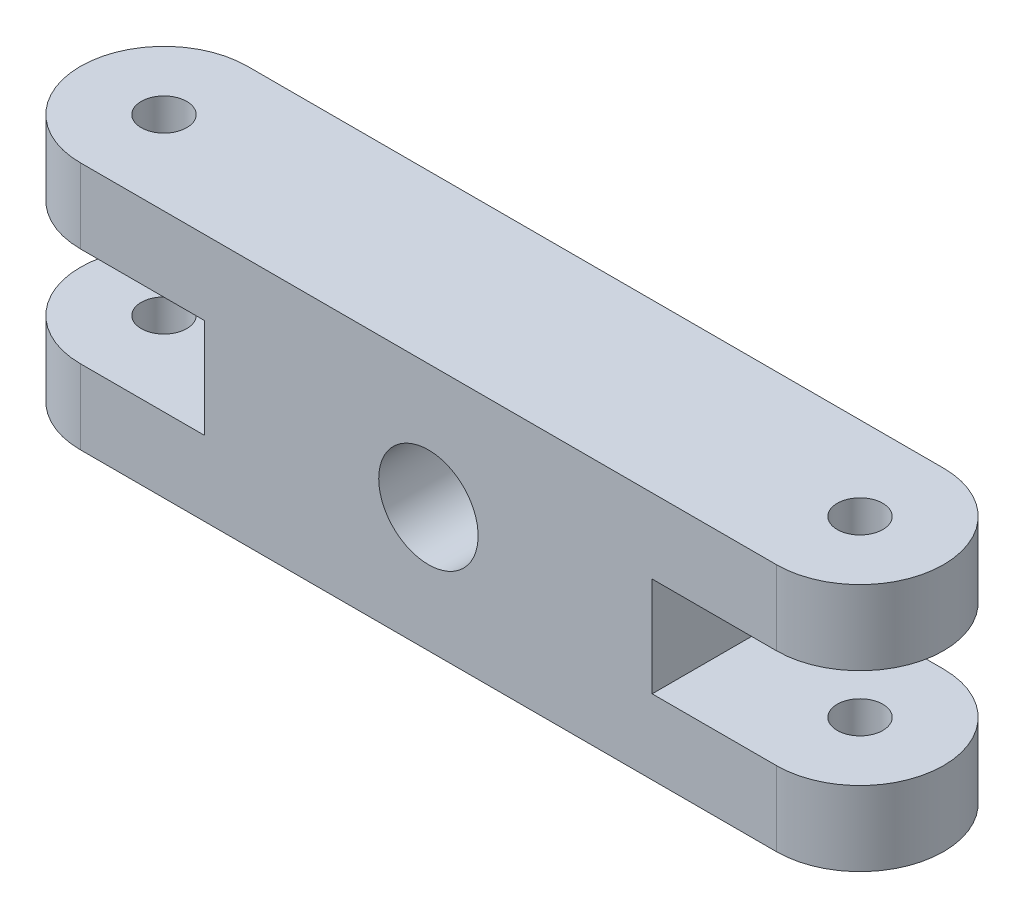
ISO-10303-21;
HEADER;
FILE_DESCRIPTION(('STEP AP214'),'2;1');
FILE_NAME('part.step','',(''),(''),'','','');
FILE_SCHEMA(('AUTOMOTIVE_DESIGN { 1 0 10303 214 1 1 1 1 }'));
ENDSEC;
DATA;
#1=APPLICATION_CONTEXT('core data for automotive mechanical design processes');
#2=APPLICATION_PROTOCOL_DEFINITION('international standard','automotive_design',2000,#1);
#3=PRODUCT_CONTEXT('',#1,'mechanical');
#4=PRODUCT('Part','Part','',(#3));
#5=PRODUCT_RELATED_PRODUCT_CATEGORY('part','',(#4));
#6=PRODUCT_DEFINITION_FORMATION('','',#4);
#7=PRODUCT_DEFINITION_CONTEXT('part definition',#1,'design');
#8=PRODUCT_DEFINITION('design','',#6,#7);
#9=PRODUCT_DEFINITION_SHAPE('','',#8);
#10=(LENGTH_UNIT() NAMED_UNIT(*) SI_UNIT(.MILLI.,.METRE.));
#11=(NAMED_UNIT(*) PLANE_ANGLE_UNIT() SI_UNIT($,.RADIAN.));
#12=(NAMED_UNIT(*) SI_UNIT($,.STERADIAN.) SOLID_ANGLE_UNIT());
#13=UNCERTAINTY_MEASURE_WITH_UNIT(LENGTH_MEASURE(1.E-05),#10,'distance_accuracy_value','');
#14=(GEOMETRIC_REPRESENTATION_CONTEXT(3) GLOBAL_UNCERTAINTY_ASSIGNED_CONTEXT((#13)) GLOBAL_UNIT_ASSIGNED_CONTEXT((#10,
#11,#12)) REPRESENTATION_CONTEXT('',''));
#15=CARTESIAN_POINT('',(0.,0.,0.));
#16=DIRECTION('',(0.,0.,1.));
#17=DIRECTION('',(1.,0.,0.));
#18=AXIS2_PLACEMENT_3D('',#15,#16,#17);
#19=CARTESIAN_POINT('',(42.,30.,0.));
#20=DIRECTION('',(0.,-1.,0.));
#21=DIRECTION('',(0.,0.,-1.));
#22=AXIS2_PLACEMENT_3D('',#19,#20,#21);
#23=CYLINDRICAL_SURFACE('',#22,10.0853398352592);
#24=DIRECTION('',(0.,-1.,0.));
#25=VECTOR('',#24,1.);
#26=CARTESIAN_POINT('',(42.,30.,10.0853398352592));
#27=LINE('',#26,#25);
#28=CARTESIAN_POINT('',(42.,30.,10.0853398352592));
#29=VERTEX_POINT('',#28);
#30=CARTESIAN_POINT('',(42.,21.,10.0853398352592));
#31=VERTEX_POINT('',#30);
#32=EDGE_CURVE('E212',#29,#31,#27,.T.);
#33=ORIENTED_EDGE('',*,*,#32,.T.);
#34=CARTESIAN_POINT('',(42.,21.,0.));
#35=DIRECTION('',(0.,1.,0.));
#36=DIRECTION('',(0.,0.,1.));
#37=AXIS2_PLACEMENT_3D('',#34,#35,#36);
#38=CIRCLE('',#37,10.0853398352592);
#39=CARTESIAN_POINT('',(42.,21.,-10.0853398352592));
#40=VERTEX_POINT('',#39);
#41=EDGE_CURVE('E172',#31,#40,#38,.T.);
#42=ORIENTED_EDGE('',*,*,#41,.T.);
#43=DIRECTION('',(0.,-1.,0.));
#44=VECTOR('',#43,1.);
#45=CARTESIAN_POINT('',(42.,30.,-10.0853398352592));
#46=LINE('',#45,#44);
#47=CARTESIAN_POINT('',(42.,30.,-10.0853398352592));
#48=VERTEX_POINT('',#47);
#49=EDGE_CURVE('E223',#48,#40,#46,.T.);
#50=ORIENTED_EDGE('',*,*,#49,.F.);
#51=CARTESIAN_POINT('',(42.,30.,0.));
#52=DIRECTION('',(0.,1.,0.));
#53=DIRECTION('',(0.,0.,1.));
#54=AXIS2_PLACEMENT_3D('',#51,#52,#53);
#55=CIRCLE('',#54,10.0853398352592);
#56=EDGE_CURVE('E179',#29,#48,#55,.T.);
#57=ORIENTED_EDGE('',*,*,#56,.F.);
#58=EDGE_LOOP('',(#33,#42,#50,#57));
#59=FACE_BOUND('',#58,.T.);
#60=ADVANCED_FACE('F35',(#59),#23,.T.);
#61=CARTESIAN_POINT('',(0.,30.,-10.0853398352592));
#62=DIRECTION('',(0.,0.,-1.));
#63=DIRECTION('',(-1.,0.,0.));
#64=AXIS2_PLACEMENT_3D('',#61,#62,#63);
#65=PLANE('',#64);
#66=CARTESIAN_POINT('',(0.,15.,-10.0853398352592));
#67=DIRECTION('',(0.,0.,-1.));
#68=DIRECTION('',(-1.,0.,0.));
#69=AXIS2_PLACEMENT_3D('',#66,#67,#68);
#70=CIRCLE('',#69,6.);
#71=CARTESIAN_POINT('',(-6.,15.,-10.0853398352592));
#72=VERTEX_POINT('',#71);
#73=EDGE_CURVE('E279',#72,#72,#70,.T.);
#74=ORIENTED_EDGE('',*,*,#73,.F.);
#75=EDGE_LOOP('',(#74));
#76=FACE_BOUND('',#75,.T.);
#77=DIRECTION('',(0.,-1.,0.));
#78=VECTOR('',#77,1.);
#79=CARTESIAN_POINT('',(-42.,30.,-10.0853398352592));
#80=LINE('',#79,#78);
#81=CARTESIAN_POINT('',(-42.,9.,-10.0853398352592));
#82=VERTEX_POINT('',#81);
#83=CARTESIAN_POINT('',(-42.,0.,-10.0853398352592));
#84=VERTEX_POINT('',#83);
#85=EDGE_CURVE('E219',#82,#84,#80,.T.);
#86=ORIENTED_EDGE('',*,*,#85,.F.);
#87=DIRECTION('',(1.,0.,0.));
#88=VECTOR('',#87,1.);
#89=CARTESIAN_POINT('',(0.,9.,-10.0853398352592));
#90=LINE('',#89,#88);
#91=CARTESIAN_POINT('',(-27.,9.,-10.0853398352592));
#92=VERTEX_POINT('',#91);
#93=EDGE_CURVE('E139',#82,#92,#90,.T.);
#94=ORIENTED_EDGE('',*,*,#93,.T.);
#95=DIRECTION('',(0.,1.,0.));
#96=VECTOR('',#95,1.);
#97=CARTESIAN_POINT('',(-27.,0.,-10.0853398352592));
#98=LINE('',#97,#96);
#99=CARTESIAN_POINT('',(-27.,21.,-10.0853398352592));
#100=VERTEX_POINT('',#99);
#101=EDGE_CURVE('E126',#92,#100,#98,.T.);
#102=ORIENTED_EDGE('',*,*,#101,.T.);
#103=DIRECTION('',(-1.,0.,0.));
#104=VECTOR('',#103,1.);
#105=CARTESIAN_POINT('',(0.,21.,-10.0853398352592));
#106=LINE('',#105,#104);
#107=CARTESIAN_POINT('',(-42.,21.,-10.0853398352592));
#108=VERTEX_POINT('',#107);
#109=EDGE_CURVE('E133',#100,#108,#106,.T.);
#110=ORIENTED_EDGE('',*,*,#109,.T.);
#111=CARTESIAN_POINT('',(-42.,30.,-10.0853398352592));
#112=VERTEX_POINT('',#111);
#113=EDGE_CURVE('E220',#112,#108,#80,.T.);
#114=ORIENTED_EDGE('',*,*,#113,.F.);
#115=DIRECTION('',(1.,0.,0.));
#116=VECTOR('',#115,1.);
#117=CARTESIAN_POINT('',(0.,30.,-10.0853398352592));
#118=LINE('',#117,#116);
#119=EDGE_CURVE('E181',#112,#48,#118,.T.);
#120=ORIENTED_EDGE('',*,*,#119,.T.);
#121=ORIENTED_EDGE('',*,*,#49,.T.);
#122=DIRECTION('',(1.,0.,0.));
#123=VECTOR('',#122,1.);
#124=CARTESIAN_POINT('',(0.,21.,-10.0853398352592));
#125=LINE('',#124,#123);
#126=CARTESIAN_POINT('',(27.,21.,-10.0853398352592));
#127=VERTEX_POINT('',#126);
#128=EDGE_CURVE('E148',#127,#40,#125,.T.);
#129=ORIENTED_EDGE('',*,*,#128,.F.);
#130=DIRECTION('',(0.,1.,0.));
#131=VECTOR('',#130,1.);
#132=CARTESIAN_POINT('',(27.,0.,-10.0853398352592));
#133=LINE('',#132,#131);
#134=CARTESIAN_POINT('',(27.,9.,-10.0853398352592));
#135=VERTEX_POINT('',#134);
#136=EDGE_CURVE('E152',#135,#127,#133,.T.);
#137=ORIENTED_EDGE('',*,*,#136,.F.);
#138=DIRECTION('',(-1.,0.,0.));
#139=VECTOR('',#138,1.);
#140=CARTESIAN_POINT('',(0.,8.99999999999999,-10.0853398352592));
#141=LINE('',#140,#139);
#142=CARTESIAN_POINT('',(42.,9.,-10.0853398352592));
#143=VERTEX_POINT('',#142);
#144=EDGE_CURVE('E150',#143,#135,#141,.T.);
#145=ORIENTED_EDGE('',*,*,#144,.F.);
#146=CARTESIAN_POINT('',(42.,0.,-10.0853398352592));
#147=VERTEX_POINT('',#146);
#148=EDGE_CURVE('E222',#143,#147,#46,.T.);
#149=ORIENTED_EDGE('',*,*,#148,.T.);
#150=DIRECTION('',(1.,0.,0.));
#151=VECTOR('',#150,1.);
#152=CARTESIAN_POINT('',(0.,0.,-10.0853398352592));
#153=LINE('',#152,#151);
#154=EDGE_CURVE('E198',#84,#147,#153,.T.);
#155=ORIENTED_EDGE('',*,*,#154,.F.);
#156=EDGE_LOOP('',(#86,#94,#102,#110,#114,#120,#121,#129,#137,#145,#149,#155));
#157=FACE_BOUND('',#156,.T.);
#158=ADVANCED_FACE('F142',(#76,#157),#65,.T.);
#159=CARTESIAN_POINT('',(-42.,30.,0.));
#160=DIRECTION('',(0.,-1.,0.));
#161=DIRECTION('',(0.,0.,-1.));
#162=AXIS2_PLACEMENT_3D('',#159,#160,#161);
#163=CYLINDRICAL_SURFACE('',#162,10.0853398352592);
#164=CARTESIAN_POINT('',(-42.,9.,0.));
#165=DIRECTION('',(0.,1.,0.));
#166=DIRECTION('',(0.,0.,1.));
#167=AXIS2_PLACEMENT_3D('',#164,#165,#166);
#168=CIRCLE('',#167,10.0853398352592);
#169=CARTESIAN_POINT('',(-42.,9.,10.0853398352592));
#170=VERTEX_POINT('',#169);
#171=EDGE_CURVE('E164',#82,#170,#168,.T.);
#172=ORIENTED_EDGE('',*,*,#171,.F.);
#173=ORIENTED_EDGE('',*,*,#85,.T.);
#174=CARTESIAN_POINT('',(-42.,0.,0.));
#175=DIRECTION('',(0.,1.,0.));
#176=DIRECTION('',(0.,0.,1.));
#177=AXIS2_PLACEMENT_3D('',#174,#175,#176);
#178=CIRCLE('',#177,10.0853398352592);
#179=CARTESIAN_POINT('',(-42.,0.,10.0853398352592));
#180=VERTEX_POINT('',#179);
#181=EDGE_CURVE('E201',#84,#180,#178,.T.);
#182=ORIENTED_EDGE('',*,*,#181,.T.);
#183=DIRECTION('',(0.,-1.,0.));
#184=VECTOR('',#183,1.);
#185=CARTESIAN_POINT('',(-42.,30.,10.0853398352592));
#186=LINE('',#185,#184);
#187=EDGE_CURVE('E215',#170,#180,#186,.T.);
#188=ORIENTED_EDGE('',*,*,#187,.F.);
#189=EDGE_LOOP('',(#172,#173,#182,#188));
#190=FACE_BOUND('',#189,.T.);
#191=ADVANCED_FACE('F274',(#190),#163,.T.);
#192=CARTESIAN_POINT('',(-42.,21.,0.));
#193=DIRECTION('',(0.,-1.,0.));
#194=DIRECTION('',(0.,0.,-1.));
#195=AXIS2_PLACEMENT_3D('',#192,#193,#194);
#196=CIRCLE('',#195,10.0853398352592);
#197=CARTESIAN_POINT('',(-42.,21.,10.0853398352592));
#198=VERTEX_POINT('',#197);
#199=EDGE_CURVE('E136',#198,#108,#196,.T.);
#200=ORIENTED_EDGE('',*,*,#199,.F.);
#201=CARTESIAN_POINT('',(-42.,30.,10.0853398352592));
#202=VERTEX_POINT('',#201);
#203=EDGE_CURVE('E216',#202,#198,#186,.T.);
#204=ORIENTED_EDGE('',*,*,#203,.F.);
#205=CARTESIAN_POINT('',(-42.,30.,0.));
#206=DIRECTION('',(0.,1.,0.));
#207=DIRECTION('',(0.,0.,1.));
#208=AXIS2_PLACEMENT_3D('',#205,#206,#207);
#209=CIRCLE('',#208,10.0853398352592);
#210=EDGE_CURVE('E185',#112,#202,#209,.T.);
#211=ORIENTED_EDGE('',*,*,#210,.F.);
#212=ORIENTED_EDGE('',*,*,#113,.T.);
#213=EDGE_LOOP('',(#200,#204,#211,#212));
#214=FACE_BOUND('',#213,.T.);
#215=ADVANCED_FACE('F254',(#214),#163,.T.);
#216=CARTESIAN_POINT('',(42.,30.,0.));
#217=DIRECTION('',(0.,-1.,0.));
#218=DIRECTION('',(0.,0.,-1.));
#219=AXIS2_PLACEMENT_3D('',#216,#217,#218);
#220=CYLINDRICAL_SURFACE('',#219,2.75);
#221=CARTESIAN_POINT('',(42.,21.,0.));
#222=DIRECTION('',(0.,1.,0.));
#223=DIRECTION('',(0.,0.,1.));
#224=AXIS2_PLACEMENT_3D('',#221,#222,#223);
#225=CIRCLE('',#224,2.75);
#226=CARTESIAN_POINT('',(42.,21.,2.75));
#227=VERTEX_POINT('',#226);
#228=EDGE_CURVE('E175',#227,#227,#225,.T.);
#229=ORIENTED_EDGE('',*,*,#228,.F.);
#230=EDGE_LOOP('',(#229));
#231=FACE_BOUND('',#230,.T.);
#232=CARTESIAN_POINT('',(42.,30.,0.));
#233=DIRECTION('',(0.,1.,0.));
#234=DIRECTION('',(0.,0.,1.));
#235=AXIS2_PLACEMENT_3D('',#232,#233,#234);
#236=CIRCLE('',#235,2.75);
#237=CARTESIAN_POINT('',(42.,30.,2.75));
#238=VERTEX_POINT('',#237);
#239=EDGE_CURVE('E189',#238,#238,#236,.T.);
#240=ORIENTED_EDGE('',*,*,#239,.T.);
#241=EDGE_LOOP('',(#240));
#242=FACE_BOUND('',#241,.T.);
#243=ADVANCED_FACE('F310',(#231,#242),#220,.F.);
#244=CARTESIAN_POINT('',(0.,30.,10.0853398352592));
#245=DIRECTION('',(0.,0.,-1.));
#246=DIRECTION('',(-1.,0.,0.));
#247=AXIS2_PLACEMENT_3D('',#244,#245,#246);
#248=PLANE('',#247);
#249=CARTESIAN_POINT('',(0.,15.,10.0853398352592));
#250=DIRECTION('',(0.,0.,-1.));
#251=DIRECTION('',(-1.,0.,0.));
#252=AXIS2_PLACEMENT_3D('',#249,#250,#251);
#253=CIRCLE('',#252,6.);
#254=CARTESIAN_POINT('',(-6.,15.,10.0853398352592));
#255=VERTEX_POINT('',#254);
#256=EDGE_CURVE('E39',#255,#255,#253,.T.);
#257=ORIENTED_EDGE('',*,*,#256,.T.);
#258=EDGE_LOOP('',(#257));
#259=FACE_BOUND('',#258,.T.);
#260=DIRECTION('',(1.,0.,0.));
#261=VECTOR('',#260,1.);
#262=CARTESIAN_POINT('',(0.,9.,10.0853398352592));
#263=LINE('',#262,#261);
#264=CARTESIAN_POINT('',(-27.,9.,10.0853398352592));
#265=VERTEX_POINT('',#264);
#266=EDGE_CURVE('E162',#170,#265,#263,.T.);
#267=ORIENTED_EDGE('',*,*,#266,.F.);
#268=ORIENTED_EDGE('',*,*,#187,.T.);
#269=DIRECTION('',(1.,0.,0.));
#270=VECTOR('',#269,1.);
#271=CARTESIAN_POINT('',(0.,0.,10.0853398352592));
#272=LINE('',#271,#270);
#273=CARTESIAN_POINT('',(42.,0.,10.0853398352592));
#274=VERTEX_POINT('',#273);
#275=EDGE_CURVE('E204',#180,#274,#272,.T.);
#276=ORIENTED_EDGE('',*,*,#275,.T.);
#277=CARTESIAN_POINT('',(42.,9.,10.0853398352592));
#278=VERTEX_POINT('',#277);
#279=EDGE_CURVE('E195',#278,#274,#27,.T.);
#280=ORIENTED_EDGE('',*,*,#279,.F.);
#281=DIRECTION('',(-1.,0.,0.));
#282=VECTOR('',#281,1.);
#283=CARTESIAN_POINT('',(0.,8.99999999999999,10.0853398352592));
#284=LINE('',#283,#282);
#285=CARTESIAN_POINT('',(27.,9.,10.0853398352592));
#286=VERTEX_POINT('',#285);
#287=EDGE_CURVE('E226',#278,#286,#284,.T.);
#288=ORIENTED_EDGE('',*,*,#287,.T.);
#289=DIRECTION('',(0.,1.,0.));
#290=VECTOR('',#289,1.);
#291=CARTESIAN_POINT('',(27.,30.,10.0853398352592));
#292=LINE('',#291,#290);
#293=CARTESIAN_POINT('',(27.,21.,10.0853398352592));
#294=VERTEX_POINT('',#293);
#295=EDGE_CURVE('E233',#286,#294,#292,.T.);
#296=ORIENTED_EDGE('',*,*,#295,.T.);
#297=DIRECTION('',(1.,0.,0.));
#298=VECTOR('',#297,1.);
#299=CARTESIAN_POINT('',(0.,21.,10.0853398352592));
#300=LINE('',#299,#298);
#301=EDGE_CURVE('E44',#294,#31,#300,.T.);
#302=ORIENTED_EDGE('',*,*,#301,.T.);
#303=ORIENTED_EDGE('',*,*,#32,.F.);
#304=DIRECTION('',(1.,0.,0.));
#305=VECTOR('',#304,1.);
#306=CARTESIAN_POINT('',(0.,30.,10.0853398352592));
#307=LINE('',#306,#305);
#308=EDGE_CURVE('E187',#202,#29,#307,.T.);
#309=ORIENTED_EDGE('',*,*,#308,.F.);
#310=ORIENTED_EDGE('',*,*,#203,.T.);
#311=DIRECTION('',(-1.,0.,0.));
#312=VECTOR('',#311,1.);
#313=CARTESIAN_POINT('',(0.,21.,10.0853398352592));
#314=LINE('',#313,#312);
#315=CARTESIAN_POINT('',(-27.,21.,10.0853398352592));
#316=VERTEX_POINT('',#315);
#317=EDGE_CURVE('E158',#316,#198,#314,.T.);
#318=ORIENTED_EDGE('',*,*,#317,.F.);
#319=DIRECTION('',(0.,1.,0.));
#320=VECTOR('',#319,1.);
#321=CARTESIAN_POINT('',(-27.,30.,10.0853398352592));
#322=LINE('',#321,#320);
#323=EDGE_CURVE('E11',#265,#316,#322,.T.);
#324=ORIENTED_EDGE('',*,*,#323,.F.);
#325=EDGE_LOOP('',(#267,#268,#276,#280,#288,#296,#302,#303,#309,#310,#318,#324));
#326=FACE_BOUND('',#325,.T.);
#327=ADVANCED_FACE('F240',(#259,#326),#248,.F.);
#328=CARTESIAN_POINT('',(-42.,30.,0.));
#329=DIRECTION('',(0.,-1.,0.));
#330=DIRECTION('',(0.,0.,-1.));
#331=AXIS2_PLACEMENT_3D('',#328,#329,#330);
#332=CYLINDRICAL_SURFACE('',#331,2.75);
#333=CARTESIAN_POINT('',(-42.,0.,0.));
#334=DIRECTION('',(0.,1.,0.));
#335=DIRECTION('',(0.,0.,1.));
#336=AXIS2_PLACEMENT_3D('',#333,#334,#335);
#337=CIRCLE('',#336,2.75);
#338=CARTESIAN_POINT('',(-42.,0.,2.75000000000001));
#339=VERTEX_POINT('',#338);
#340=EDGE_CURVE('E182',#339,#339,#337,.T.);
#341=ORIENTED_EDGE('',*,*,#340,.F.);
#342=EDGE_LOOP('',(#341));
#343=FACE_BOUND('',#342,.T.);
#344=CARTESIAN_POINT('',(-42.,9.,0.));
#345=DIRECTION('',(0.,1.,0.));
#346=DIRECTION('',(0.,0.,1.));
#347=AXIS2_PLACEMENT_3D('',#344,#345,#346);
#348=CIRCLE('',#347,2.75);
#349=CARTESIAN_POINT('',(-42.,9.,2.75000000000001));
#350=VERTEX_POINT('',#349);
#351=EDGE_CURVE('E161',#350,#350,#348,.T.);
#352=ORIENTED_EDGE('',*,*,#351,.T.);
#353=EDGE_LOOP('',(#352));
#354=FACE_BOUND('',#353,.T.);
#355=ADVANCED_FACE('F311',(#343,#354),#332,.F.);
#356=CARTESIAN_POINT('',(-42.,30.,0.));
#357=DIRECTION('',(0.,1.,0.));
#358=DIRECTION('',(0.,0.,1.));
#359=AXIS2_PLACEMENT_3D('',#356,#357,#358);
#360=CIRCLE('',#359,2.75);
#361=CARTESIAN_POINT('',(-42.,30.,2.75000000000001));
#362=VERTEX_POINT('',#361);
#363=EDGE_CURVE('E192',#362,#362,#360,.T.);
#364=ORIENTED_EDGE('',*,*,#363,.T.);
#365=EDGE_LOOP('',(#364));
#366=FACE_BOUND('',#365,.T.);
#367=CARTESIAN_POINT('',(-42.,21.,0.));
#368=DIRECTION('',(0.,-1.,0.));
#369=DIRECTION('',(0.,0.,-1.));
#370=AXIS2_PLACEMENT_3D('',#367,#368,#369);
#371=CIRCLE('',#370,2.75);
#372=CARTESIAN_POINT('',(-42.,21.,-2.75));
#373=VERTEX_POINT('',#372);
#374=EDGE_CURVE('E146',#373,#373,#371,.T.);
#375=ORIENTED_EDGE('',*,*,#374,.T.);
#376=EDGE_LOOP('',(#375));
#377=FACE_BOUND('',#376,.T.);
#378=ADVANCED_FACE('F303',(#366,#377),#332,.F.);
#379=ORIENTED_EDGE('',*,*,#148,.F.);
#380=CARTESIAN_POINT('',(42.,9.,0.));
#381=DIRECTION('',(0.,-1.,0.));
#382=DIRECTION('',(1.,0.,0.));
#383=AXIS2_PLACEMENT_3D('',#380,#381,#382);
#384=CIRCLE('',#383,10.0853398352592);
#385=EDGE_CURVE('E166',#143,#278,#384,.T.);
#386=ORIENTED_EDGE('',*,*,#385,.T.);
#387=ORIENTED_EDGE('',*,*,#279,.T.);
#388=CARTESIAN_POINT('',(42.,0.,0.));
#389=DIRECTION('',(0.,1.,0.));
#390=DIRECTION('',(0.,0.,1.));
#391=AXIS2_PLACEMENT_3D('',#388,#389,#390);
#392=CIRCLE('',#391,10.0853398352592);
#393=EDGE_CURVE('E178',#274,#147,#392,.T.);
#394=ORIENTED_EDGE('',*,*,#393,.T.);
#395=EDGE_LOOP('',(#379,#386,#387,#394));
#396=FACE_BOUND('',#395,.T.);
#397=ADVANCED_FACE('F37',(#396),#23,.T.);
#398=CARTESIAN_POINT('',(42.,9.,0.));
#399=DIRECTION('',(0.,-1.,0.));
#400=DIRECTION('',(1.,0.,0.));
#401=AXIS2_PLACEMENT_3D('',#398,#399,#400);
#402=CIRCLE('',#401,2.75);
#403=CARTESIAN_POINT('',(44.75,9.,0.));
#404=VERTEX_POINT('',#403);
#405=EDGE_CURVE('E169',#404,#404,#402,.T.);
#406=ORIENTED_EDGE('',*,*,#405,.F.);
#407=EDGE_LOOP('',(#406));
#408=FACE_BOUND('',#407,.T.);
#409=CARTESIAN_POINT('',(42.,0.,0.));
#410=DIRECTION('',(0.,1.,0.));
#411=DIRECTION('',(0.,0.,1.));
#412=AXIS2_PLACEMENT_3D('',#409,#410,#411);
#413=CIRCLE('',#412,2.75);
#414=CARTESIAN_POINT('',(42.,0.,2.75));
#415=VERTEX_POINT('',#414);
#416=EDGE_CURVE('E207',#415,#415,#413,.T.);
#417=ORIENTED_EDGE('',*,*,#416,.F.);
#418=EDGE_LOOP('',(#417));
#419=FACE_BOUND('',#418,.T.);
#420=ADVANCED_FACE('F302',(#408,#419),#220,.F.);
#421=CARTESIAN_POINT('',(0.,30.,0.));
#422=DIRECTION('',(0.,1.,0.));
#423=DIRECTION('',(0.,0.,1.));
#424=AXIS2_PLACEMENT_3D('',#421,#422,#423);
#425=PLANE('',#424);
#426=ORIENTED_EDGE('',*,*,#56,.T.);
#427=ORIENTED_EDGE('',*,*,#119,.F.);
#428=ORIENTED_EDGE('',*,*,#210,.T.);
#429=ORIENTED_EDGE('',*,*,#308,.T.);
#430=EDGE_LOOP('',(#426,#427,#428,#429));
#431=FACE_BOUND('',#430,.T.);
#432=ORIENTED_EDGE('',*,*,#239,.F.);
#433=EDGE_LOOP('',(#432));
#434=FACE_BOUND('',#433,.T.);
#435=ORIENTED_EDGE('',*,*,#363,.F.);
#436=EDGE_LOOP('',(#435));
#437=FACE_BOUND('',#436,.T.);
#438=ADVANCED_FACE('F249',(#431,#434,#437),#425,.T.);
#439=CARTESIAN_POINT('',(0.,0.,0.));
#440=DIRECTION('',(0.,1.,0.));
#441=DIRECTION('',(0.,0.,1.));
#442=AXIS2_PLACEMENT_3D('',#439,#440,#441);
#443=PLANE('',#442);
#444=ORIENTED_EDGE('',*,*,#393,.F.);
#445=ORIENTED_EDGE('',*,*,#275,.F.);
#446=ORIENTED_EDGE('',*,*,#181,.F.);
#447=ORIENTED_EDGE('',*,*,#154,.T.);
#448=EDGE_LOOP('',(#444,#445,#446,#447));
#449=FACE_BOUND('',#448,.T.);
#450=ORIENTED_EDGE('',*,*,#416,.T.);
#451=EDGE_LOOP('',(#450));
#452=FACE_BOUND('',#451,.T.);
#453=ORIENTED_EDGE('',*,*,#340,.T.);
#454=EDGE_LOOP('',(#453));
#455=FACE_BOUND('',#454,.T.);
#456=ADVANCED_FACE('F270',(#449,#452,#455),#443,.F.);
#457=CARTESIAN_POINT('',(-27.,0.,16.9146601647408));
#458=DIRECTION('',(-1.,0.,0.));
#459=DIRECTION('',(0.,0.,1.));
#460=AXIS2_PLACEMENT_3D('',#457,#458,#459);
#461=PLANE('',#460);
#462=ORIENTED_EDGE('',*,*,#323,.T.);
#463=DIRECTION('',(0.,0.,-1.));
#464=VECTOR('',#463,1.);
#465=CARTESIAN_POINT('',(-27.,21.,16.9146601647408));
#466=LINE('',#465,#464);
#467=EDGE_CURVE('E51',#316,#100,#466,.T.);
#468=ORIENTED_EDGE('',*,*,#467,.T.);
#469=ORIENTED_EDGE('',*,*,#101,.F.);
#470=DIRECTION('',(0.,0.,-1.));
#471=VECTOR('',#470,1.);
#472=CARTESIAN_POINT('',(-27.,9.,16.9146601647408));
#473=LINE('',#472,#471);
#474=EDGE_CURVE('E130',#265,#92,#473,.T.);
#475=ORIENTED_EDGE('',*,*,#474,.F.);
#476=EDGE_LOOP('',(#462,#468,#469,#475));
#477=FACE_BOUND('',#476,.T.);
#478=ADVANCED_FACE('F123',(#477),#461,.T.);
#479=CARTESIAN_POINT('',(0.,9.,16.9146601647408));
#480=DIRECTION('',(0.,1.,0.));
#481=DIRECTION('',(0.,0.,1.));
#482=AXIS2_PLACEMENT_3D('',#479,#480,#481);
#483=PLANE('',#482);
#484=ORIENTED_EDGE('',*,*,#351,.F.);
#485=EDGE_LOOP('',(#484));
#486=FACE_BOUND('',#485,.T.);
#487=ORIENTED_EDGE('',*,*,#171,.T.);
#488=ORIENTED_EDGE('',*,*,#266,.T.);
#489=ORIENTED_EDGE('',*,*,#474,.T.);
#490=ORIENTED_EDGE('',*,*,#93,.F.);
#491=EDGE_LOOP('',(#487,#488,#489,#490));
#492=FACE_BOUND('',#491,.T.);
#493=ADVANCED_FACE('F277',(#486,#492),#483,.T.);
#494=CARTESIAN_POINT('',(0.,21.,16.9146601647408));
#495=DIRECTION('',(0.,-1.,0.));
#496=DIRECTION('',(0.,0.,-1.));
#497=AXIS2_PLACEMENT_3D('',#494,#495,#496);
#498=PLANE('',#497);
#499=ORIENTED_EDGE('',*,*,#374,.F.);
#500=EDGE_LOOP('',(#499));
#501=FACE_BOUND('',#500,.T.);
#502=ORIENTED_EDGE('',*,*,#199,.T.);
#503=ORIENTED_EDGE('',*,*,#109,.F.);
#504=ORIENTED_EDGE('',*,*,#467,.F.);
#505=ORIENTED_EDGE('',*,*,#317,.T.);
#506=EDGE_LOOP('',(#502,#503,#504,#505));
#507=FACE_BOUND('',#506,.T.);
#508=ADVANCED_FACE('F134',(#501,#507),#498,.T.);
#509=CARTESIAN_POINT('',(0.,21.,16.9146601647408));
#510=DIRECTION('',(0.,1.,0.));
#511=DIRECTION('',(0.,0.,1.));
#512=AXIS2_PLACEMENT_3D('',#509,#510,#511);
#513=PLANE('',#512);
#514=ORIENTED_EDGE('',*,*,#228,.T.);
#515=EDGE_LOOP('',(#514));
#516=FACE_BOUND('',#515,.T.);
#517=ORIENTED_EDGE('',*,*,#301,.F.);
#518=DIRECTION('',(0.,0.,-1.));
#519=VECTOR('',#518,1.);
#520=CARTESIAN_POINT('',(27.,21.,16.9146601647408));
#521=LINE('',#520,#519);
#522=EDGE_CURVE('E155',#294,#127,#521,.T.);
#523=ORIENTED_EDGE('',*,*,#522,.T.);
#524=ORIENTED_EDGE('',*,*,#128,.T.);
#525=ORIENTED_EDGE('',*,*,#41,.F.);
#526=EDGE_LOOP('',(#517,#523,#524,#525));
#527=FACE_BOUND('',#526,.T.);
#528=ADVANCED_FACE('F258',(#516,#527),#513,.F.);
#529=CARTESIAN_POINT('',(27.,0.,16.9146601647408));
#530=DIRECTION('',(-1.,0.,0.));
#531=DIRECTION('',(0.,0.,1.));
#532=AXIS2_PLACEMENT_3D('',#529,#530,#531);
#533=PLANE('',#532);
#534=DIRECTION('',(0.,0.,-1.));
#535=VECTOR('',#534,1.);
#536=CARTESIAN_POINT('',(27.,9.,16.9146601647408));
#537=LINE('',#536,#535);
#538=EDGE_CURVE('E58',#286,#135,#537,.T.);
#539=ORIENTED_EDGE('',*,*,#538,.T.);
#540=ORIENTED_EDGE('',*,*,#136,.T.);
#541=ORIENTED_EDGE('',*,*,#522,.F.);
#542=ORIENTED_EDGE('',*,*,#295,.F.);
#543=EDGE_LOOP('',(#539,#540,#541,#542));
#544=FACE_BOUND('',#543,.T.);
#545=ADVANCED_FACE('F260',(#544),#533,.F.);
#546=CARTESIAN_POINT('',(0.,8.99999999999999,16.9146601647408));
#547=DIRECTION('',(0.,-1.,0.));
#548=DIRECTION('',(1.,0.,0.));
#549=AXIS2_PLACEMENT_3D('',#546,#547,#548);
#550=PLANE('',#549);
#551=ORIENTED_EDGE('',*,*,#405,.T.);
#552=EDGE_LOOP('',(#551));
#553=FACE_BOUND('',#552,.T.);
#554=ORIENTED_EDGE('',*,*,#144,.T.);
#555=ORIENTED_EDGE('',*,*,#538,.F.);
#556=ORIENTED_EDGE('',*,*,#287,.F.);
#557=ORIENTED_EDGE('',*,*,#385,.F.);
#558=EDGE_LOOP('',(#554,#555,#556,#557));
#559=FACE_BOUND('',#558,.T.);
#560=ADVANCED_FACE('F261',(#553,#559),#550,.F.);
#561=CARTESIAN_POINT('',(0.,15.,16.9146601647408));
#562=DIRECTION('',(0.,0.,-1.));
#563=DIRECTION('',(-1.,0.,0.));
#564=AXIS2_PLACEMENT_3D('',#561,#562,#563);
#565=CYLINDRICAL_SURFACE('',#564,6.);
#566=ORIENTED_EDGE('',*,*,#73,.T.);
#567=EDGE_LOOP('',(#566));
#568=FACE_BOUND('',#567,.T.);
#569=ORIENTED_EDGE('',*,*,#256,.F.);
#570=EDGE_LOOP('',(#569));
#571=FACE_BOUND('',#570,.T.);
#572=ADVANCED_FACE('F287',(#568,#571),#565,.F.);
#573=CLOSED_SHELL('',(#60,#158,#191,#215,#243,#327,#355,#378,#397,#420,#438,#456,#478,#493,#508,
#528,#545,#560,#572));
#574=MANIFOLD_SOLID_BREP('B2',#573);
#575=ADVANCED_BREP_SHAPE_REPRESENTATION('',(#18,#574),#14);
#576=SHAPE_DEFINITION_REPRESENTATION(#9,#575);
ENDSEC;
END-ISO-10303-21;
